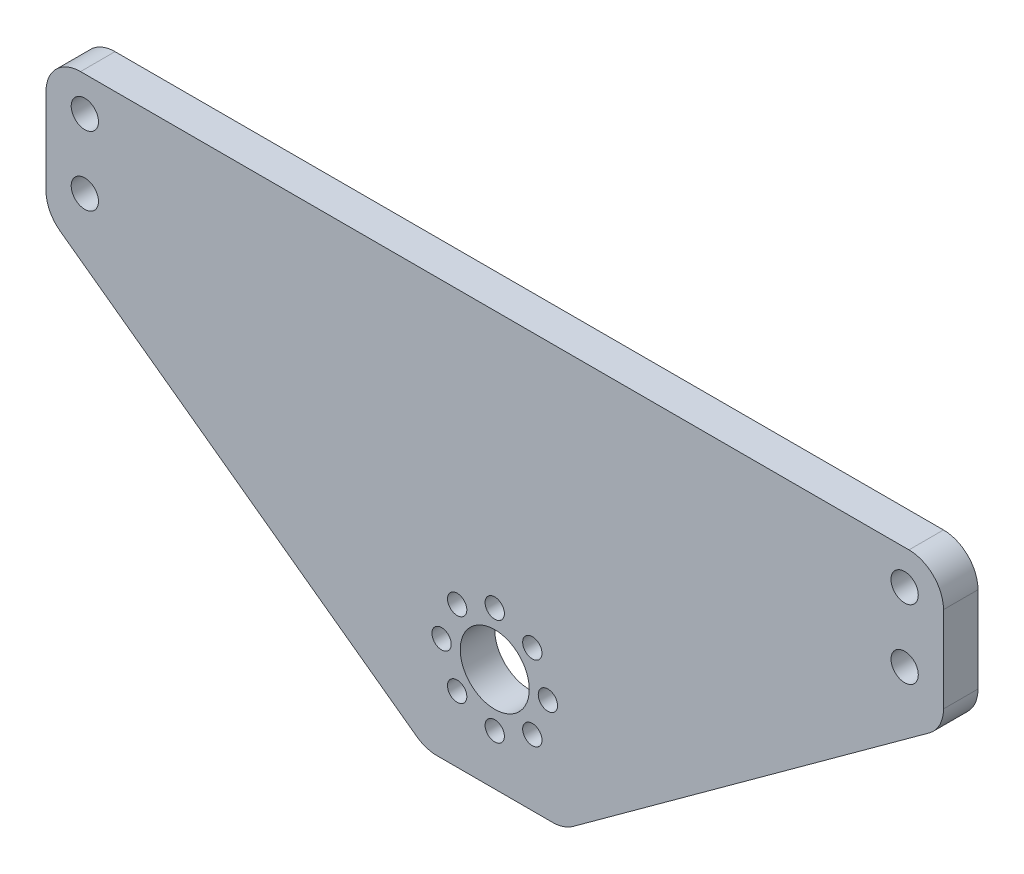
ISO-10303-21;
HEADER;
FILE_DESCRIPTION(('STEP AP214'),'2;1');
FILE_NAME('part.step','',(''),(''),'','','');
FILE_SCHEMA(('AUTOMOTIVE_DESIGN { 1 0 10303 214 1 1 1 1 }'));
ENDSEC;
DATA;
#1=APPLICATION_CONTEXT('core data for automotive mechanical design processes');
#2=APPLICATION_PROTOCOL_DEFINITION('international standard','automotive_design',2000,#1);
#3=PRODUCT_CONTEXT('',#1,'mechanical');
#4=PRODUCT('Part','Part','',(#3));
#5=PRODUCT_RELATED_PRODUCT_CATEGORY('part','',(#4));
#6=PRODUCT_DEFINITION_FORMATION('','',#4);
#7=PRODUCT_DEFINITION_CONTEXT('part definition',#1,'design');
#8=PRODUCT_DEFINITION('design','',#6,#7);
#9=PRODUCT_DEFINITION_SHAPE('','',#8);
#10=(LENGTH_UNIT() NAMED_UNIT(*) SI_UNIT(.MILLI.,.METRE.));
#11=(NAMED_UNIT(*) PLANE_ANGLE_UNIT() SI_UNIT($,.RADIAN.));
#12=(NAMED_UNIT(*) SI_UNIT($,.STERADIAN.) SOLID_ANGLE_UNIT());
#13=UNCERTAINTY_MEASURE_WITH_UNIT(LENGTH_MEASURE(1.E-05),#10,'distance_accuracy_value','');
#14=(GEOMETRIC_REPRESENTATION_CONTEXT(3) GLOBAL_UNCERTAINTY_ASSIGNED_CONTEXT((#13)) GLOBAL_UNIT_ASSIGNED_CONTEXT((#10,
#11,#12)) REPRESENTATION_CONTEXT('',''));
#15=CARTESIAN_POINT('',(0.,0.,0.));
#16=DIRECTION('',(0.,0.,1.));
#17=DIRECTION('',(1.,0.,0.));
#18=AXIS2_PLACEMENT_3D('',#15,#16,#17);
#19=CARTESIAN_POINT('',(0.,0.,6.35));
#20=DIRECTION('',(0.,0.,-1.));
#21=DIRECTION('',(-1.,0.,0.));
#22=AXIS2_PLACEMENT_3D('',#19,#20,#21);
#23=PLANE('',#22);
#24=CARTESIAN_POINT('',(-9.779,-19.05,6.35));
#25=DIRECTION('',(0.,0.,-1.));
#26=DIRECTION('',(0.,-1.,0.));
#27=AXIS2_PLACEMENT_3D('',#24,#25,#26);
#28=CIRCLE('',#27,1.778);
#29=CARTESIAN_POINT('',(-9.77899999999999,-20.828,6.35));
#30=VERTEX_POINT('',#29);
#31=EDGE_CURVE('E505',#30,#30,#28,.T.);
#32=ORIENTED_EDGE('',*,*,#31,.T.);
#33=EDGE_LOOP('',(#32));
#34=FACE_BOUND('',#33,.T.);
#35=CARTESIAN_POINT('',(-6.91479721322321,-25.9647972132233,6.35));
#36=DIRECTION('',(0.,0.,-1.));
#37=DIRECTION('',(0.707106781186551,-0.707106781186544,0.));
#38=AXIS2_PLACEMENT_3D('',#35,#36,#37);
#39=CIRCLE('',#38,1.778);
#40=CARTESIAN_POINT('',(-5.65756135627352,-27.222033070173,6.35));
#41=VERTEX_POINT('',#40);
#42=EDGE_CURVE('E509',#41,#41,#39,.T.);
#43=ORIENTED_EDGE('',*,*,#42,.T.);
#44=EDGE_LOOP('',(#43));
#45=FACE_BOUND('',#44,.T.);
#46=CARTESIAN_POINT('',(0.,-28.829,6.35));
#47=DIRECTION('',(0.,0.,-1.));
#48=DIRECTION('',(1.,0.,0.));
#49=AXIS2_PLACEMENT_3D('',#46,#47,#48);
#50=CIRCLE('',#49,1.778);
#51=CARTESIAN_POINT('',(1.778,-28.829,6.35));
#52=VERTEX_POINT('',#51);
#53=EDGE_CURVE('E520',#52,#52,#50,.T.);
#54=ORIENTED_EDGE('',*,*,#53,.T.);
#55=EDGE_LOOP('',(#54));
#56=FACE_BOUND('',#55,.T.);
#57=CARTESIAN_POINT('',(6.91479721322331,-25.9647972132232,6.35));
#58=DIRECTION('',(0.,0.,-1.));
#59=DIRECTION('',(0.707106781186541,0.707106781186554,0.));
#60=AXIS2_PLACEMENT_3D('',#57,#58,#59);
#61=CIRCLE('',#60,1.778);
#62=CARTESIAN_POINT('',(8.17203307017298,-24.7075613562735,6.35));
#63=VERTEX_POINT('',#62);
#64=EDGE_CURVE('E526',#63,#63,#61,.T.);
#65=ORIENTED_EDGE('',*,*,#64,.T.);
#66=EDGE_LOOP('',(#65));
#67=FACE_BOUND('',#66,.T.);
#68=CARTESIAN_POINT('',(9.779,-19.0499999999999,6.35));
#69=DIRECTION('',(0.,0.,-1.));
#70=DIRECTION('',(0.,1.,0.));
#71=AXIS2_PLACEMENT_3D('',#68,#69,#70);
#72=CIRCLE('',#71,1.778);
#73=CARTESIAN_POINT('',(9.77899999999998,-17.2719999999999,6.35));
#74=VERTEX_POINT('',#73);
#75=EDGE_CURVE('E532',#74,#74,#72,.T.);
#76=ORIENTED_EDGE('',*,*,#75,.T.);
#77=EDGE_LOOP('',(#76));
#78=FACE_BOUND('',#77,.T.);
#79=CARTESIAN_POINT('',(6.91479721322316,-12.1352027867767,6.35));
#80=DIRECTION('',(0.,0.,-1.));
#81=DIRECTION('',(-0.707106781186556,0.707106781186539,0.));
#82=AXIS2_PLACEMENT_3D('',#79,#80,#81);
#83=CIRCLE('',#82,1.778);
#84=CARTESIAN_POINT('',(5.65756135627347,-10.877966929827,6.35));
#85=VERTEX_POINT('',#84);
#86=EDGE_CURVE('E563',#85,#85,#83,.T.);
#87=ORIENTED_EDGE('',*,*,#86,.T.);
#88=EDGE_LOOP('',(#87));
#89=FACE_BOUND('',#88,.T.);
#90=CARTESIAN_POINT('',(-6.91479721322326,-12.1352027867768,6.35));
#91=DIRECTION('',(0.,0.,-1.));
#92=DIRECTION('',(-0.707106781186546,-0.707106781186549,0.));
#93=AXIS2_PLACEMENT_3D('',#90,#91,#92);
#94=CIRCLE('',#93,1.778);
#95=CARTESIAN_POINT('',(-8.17203307017294,-13.3924386437265,6.35));
#96=VERTEX_POINT('',#95);
#97=EDGE_CURVE('E533',#96,#96,#94,.T.);
#98=ORIENTED_EDGE('',*,*,#97,.T.);
#99=EDGE_LOOP('',(#98));
#100=FACE_BOUND('',#99,.T.);
#101=CARTESIAN_POINT('',(0.,-9.271,6.35));
#102=DIRECTION('',(0.,0.,-1.));
#103=DIRECTION('',(-1.,0.,0.));
#104=AXIS2_PLACEMENT_3D('',#101,#102,#103);
#105=CIRCLE('',#104,1.778);
#106=CARTESIAN_POINT('',(-1.778,-9.271,6.35));
#107=VERTEX_POINT('',#106);
#108=EDGE_CURVE('E229',#107,#107,#105,.T.);
#109=ORIENTED_EDGE('',*,*,#108,.T.);
#110=EDGE_LOOP('',(#109));
#111=FACE_BOUND('',#110,.T.);
#112=DIRECTION('',(-1.,0.,0.));
#113=VECTOR('',#112,1.);
#114=CARTESIAN_POINT('',(82.55,38.1,6.35));
#115=LINE('',#114,#113);
#116=CARTESIAN_POINT('',(76.2,38.1,6.35));
#117=VERTEX_POINT('',#116);
#118=CARTESIAN_POINT('',(-76.2,38.1,6.35));
#119=VERTEX_POINT('',#118);
#120=EDGE_CURVE('E161',#117,#119,#115,.T.);
#121=ORIENTED_EDGE('',*,*,#120,.T.);
#122=CARTESIAN_POINT('',(-76.2,31.75,6.35));
#123=DIRECTION('',(0.,0.,-1.));
#124=DIRECTION('',(-1.,0.,0.));
#125=AXIS2_PLACEMENT_3D('',#122,#123,#124);
#126=CIRCLE('',#125,6.35);
#127=CARTESIAN_POINT('',(-82.55,31.75,6.35));
#128=VERTEX_POINT('',#127);
#129=EDGE_CURVE('E187',#119,#128,#126,.F.);
#130=ORIENTED_EDGE('',*,*,#129,.T.);
#131=DIRECTION('',(0.,-1.,0.));
#132=VECTOR('',#131,1.);
#133=CARTESIAN_POINT('',(-82.55,38.1,6.35));
#134=LINE('',#133,#132);
#135=CARTESIAN_POINT('',(-82.55,15.9335761573154,6.35));
#136=VERTEX_POINT('',#135);
#137=EDGE_CURVE('E143',#128,#136,#134,.T.);
#138=ORIENTED_EDGE('',*,*,#137,.T.);
#139=CARTESIAN_POINT('',(-76.2,15.9335761573154,6.35));
#140=DIRECTION('',(0.,0.,-1.));
#141=DIRECTION('',(-1.,0.,0.));
#142=AXIS2_PLACEMENT_3D('',#139,#140,#141);
#143=CIRCLE('',#142,6.35);
#144=CARTESIAN_POINT('',(-79.9348902802365,10.7981020219902,6.35));
#145=VERTEX_POINT('',#144);
#146=EDGE_CURVE('E184',#136,#145,#143,.F.);
#147=ORIENTED_EDGE('',*,*,#146,.T.);
#148=DIRECTION('',(0.808736084303189,-0.588171697675046,0.));
#149=VECTOR('',#148,1.);
#150=CARTESIAN_POINT('',(-12.7,-38.1,6.35));
#151=LINE('',#150,#149);
#152=CARTESIAN_POINT('',(-14.3699730639278,-36.8854741353253,6.35));
#153=VERTEX_POINT('',#152);
#154=EDGE_CURVE('E245',#145,#153,#151,.T.);
#155=ORIENTED_EDGE('',*,*,#154,.T.);
#156=CARTESIAN_POINT('',(-10.6350827836912,-31.75,6.35));
#157=DIRECTION('',(0.,0.,-1.));
#158=DIRECTION('',(-1.,0.,0.));
#159=AXIS2_PLACEMENT_3D('',#156,#157,#158);
#160=CIRCLE('',#159,6.35);
#161=CARTESIAN_POINT('',(-10.6350827836912,-38.1,6.35));
#162=VERTEX_POINT('',#161);
#163=EDGE_CURVE('E182',#153,#162,#160,.F.);
#164=ORIENTED_EDGE('',*,*,#163,.T.);
#165=DIRECTION('',(1.,0.,0.));
#166=VECTOR('',#165,1.);
#167=CARTESIAN_POINT('',(82.55,-38.1,6.35));
#168=LINE('',#167,#166);
#169=CARTESIAN_POINT('',(10.6350827836913,-38.1,6.35));
#170=VERTEX_POINT('',#169);
#171=EDGE_CURVE('E207',#162,#170,#168,.T.);
#172=ORIENTED_EDGE('',*,*,#171,.T.);
#173=CARTESIAN_POINT('',(10.6350827836913,-31.75,6.35));
#174=DIRECTION('',(0.,0.,-1.));
#175=DIRECTION('',(-1.,0.,0.));
#176=AXIS2_PLACEMENT_3D('',#173,#174,#175);
#177=CIRCLE('',#176,6.35);
#178=CARTESIAN_POINT('',(14.3699730639278,-36.8854741353253,6.35));
#179=VERTEX_POINT('',#178);
#180=EDGE_CURVE('E180',#170,#179,#177,.F.);
#181=ORIENTED_EDGE('',*,*,#180,.T.);
#182=DIRECTION('',(0.808736084303188,0.588171697675046,0.));
#183=VECTOR('',#182,1.);
#184=CARTESIAN_POINT('',(82.55,12.7,6.35));
#185=LINE('',#184,#183);
#186=CARTESIAN_POINT('',(79.9348902802366,10.7981020219902,6.35));
#187=VERTEX_POINT('',#186);
#188=EDGE_CURVE('E227',#179,#187,#185,.T.);
#189=ORIENTED_EDGE('',*,*,#188,.T.);
#190=CARTESIAN_POINT('',(76.2,15.9335761573155,6.35));
#191=DIRECTION('',(0.,0.,-1.));
#192=DIRECTION('',(-1.,0.,0.));
#193=AXIS2_PLACEMENT_3D('',#190,#191,#192);
#194=CIRCLE('',#193,6.35);
#195=CARTESIAN_POINT('',(82.55,15.9335761573155,6.35));
#196=VERTEX_POINT('',#195);
#197=EDGE_CURVE('E54',#187,#196,#194,.F.);
#198=ORIENTED_EDGE('',*,*,#197,.T.);
#199=DIRECTION('',(0.,1.,0.));
#200=VECTOR('',#199,1.);
#201=CARTESIAN_POINT('',(82.55,38.1,6.35));
#202=LINE('',#201,#200);
#203=CARTESIAN_POINT('',(82.55,31.75,6.35));
#204=VERTEX_POINT('',#203);
#205=EDGE_CURVE('E217',#196,#204,#202,.T.);
#206=ORIENTED_EDGE('',*,*,#205,.T.);
#207=CARTESIAN_POINT('',(76.2,31.75,6.35));
#208=DIRECTION('',(0.,0.,-1.));
#209=DIRECTION('',(-1.,0.,0.));
#210=AXIS2_PLACEMENT_3D('',#207,#208,#209);
#211=CIRCLE('',#210,6.35);
#212=EDGE_CURVE('E178',#204,#117,#211,.F.);
#213=ORIENTED_EDGE('',*,*,#212,.T.);
#214=EDGE_LOOP('',(#121,#130,#138,#147,#155,#164,#172,#181,#189,#198,#206,#213));
#215=FACE_BOUND('',#214,.T.);
#216=CARTESIAN_POINT('',(0.,-19.05,6.35));
#217=DIRECTION('',(0.,0.,1.));
#218=DIRECTION('',(1.,0.,0.));
#219=AXIS2_PLACEMENT_3D('',#216,#217,#218);
#220=CIRCLE('',#219,6.35);
#221=CARTESIAN_POINT('',(6.35,-19.05,6.35));
#222=VERTEX_POINT('',#221);
#223=EDGE_CURVE('E152',#222,#222,#220,.T.);
#224=ORIENTED_EDGE('',*,*,#223,.F.);
#225=EDGE_LOOP('',(#224));
#226=FACE_BOUND('',#225,.T.);
#227=CARTESIAN_POINT('',(-75.40625,31.75,6.35));
#228=DIRECTION('',(0.,0.,1.));
#229=DIRECTION('',(1.,0.,0.));
#230=AXIS2_PLACEMENT_3D('',#227,#228,#229);
#231=CIRCLE('',#230,2.50825000000001);
#232=CARTESIAN_POINT('',(-72.898,31.75,6.35));
#233=VERTEX_POINT('',#232);
#234=EDGE_CURVE('E258',#233,#233,#231,.T.);
#235=ORIENTED_EDGE('',*,*,#234,.F.);
#236=EDGE_LOOP('',(#235));
#237=FACE_BOUND('',#236,.T.);
#238=CARTESIAN_POINT('',(75.40625,31.75,6.35));
#239=DIRECTION('',(0.,0.,1.));
#240=DIRECTION('',(1.,0.,0.));
#241=AXIS2_PLACEMENT_3D('',#238,#239,#240);
#242=CIRCLE('',#241,2.50825000000001);
#243=CARTESIAN_POINT('',(77.9145,31.75,6.35));
#244=VERTEX_POINT('',#243);
#245=EDGE_CURVE('E252',#244,#244,#242,.T.);
#246=ORIENTED_EDGE('',*,*,#245,.F.);
#247=EDGE_LOOP('',(#246));
#248=FACE_BOUND('',#247,.T.);
#249=CARTESIAN_POINT('',(75.40625,19.05,6.35));
#250=DIRECTION('',(0.,0.,1.));
#251=DIRECTION('',(1.,0.,0.));
#252=AXIS2_PLACEMENT_3D('',#249,#250,#251);
#253=CIRCLE('',#252,2.50825000000001);
#254=CARTESIAN_POINT('',(77.9145,19.05,6.35));
#255=VERTEX_POINT('',#254);
#256=EDGE_CURVE('E246',#255,#255,#253,.T.);
#257=ORIENTED_EDGE('',*,*,#256,.F.);
#258=EDGE_LOOP('',(#257));
#259=FACE_BOUND('',#258,.T.);
#260=CARTESIAN_POINT('',(-75.40625,19.05,6.35));
#261=DIRECTION('',(0.,0.,1.));
#262=DIRECTION('',(1.,0.,0.));
#263=AXIS2_PLACEMENT_3D('',#260,#261,#262);
#264=CIRCLE('',#263,2.50825000000001);
#265=CARTESIAN_POINT('',(-72.898,19.05,6.35));
#266=VERTEX_POINT('',#265);
#267=EDGE_CURVE('E238',#266,#266,#264,.T.);
#268=ORIENTED_EDGE('',*,*,#267,.F.);
#269=EDGE_LOOP('',(#268));
#270=FACE_BOUND('',#269,.T.);
#271=ADVANCED_FACE('F32',(#34,#45,#56,#67,#78,#89,#100,#111,#215,#226,#237,#248,#259,#270),#23,.F.);
#272=CARTESIAN_POINT('',(0.,0.,0.));
#273=DIRECTION('',(0.,0.,-1.));
#274=DIRECTION('',(-1.,0.,0.));
#275=AXIS2_PLACEMENT_3D('',#272,#273,#274);
#276=PLANE('',#275);
#277=CARTESIAN_POINT('',(-9.779,-19.05,0.));
#278=DIRECTION('',(0.,0.,-1.));
#279=DIRECTION('',(0.,-1.,0.));
#280=AXIS2_PLACEMENT_3D('',#277,#278,#279);
#281=CIRCLE('',#280,1.778);
#282=CARTESIAN_POINT('',(-9.77899999999999,-20.828,0.));
#283=VERTEX_POINT('',#282);
#284=EDGE_CURVE('E508',#283,#283,#281,.T.);
#285=ORIENTED_EDGE('',*,*,#284,.F.);
#286=EDGE_LOOP('',(#285));
#287=FACE_BOUND('',#286,.T.);
#288=CARTESIAN_POINT('',(-6.91479721322321,-25.9647972132233,0.));
#289=DIRECTION('',(0.,0.,-1.));
#290=DIRECTION('',(0.707106781186551,-0.707106781186544,0.));
#291=AXIS2_PLACEMENT_3D('',#288,#289,#290);
#292=CIRCLE('',#291,1.778);
#293=CARTESIAN_POINT('',(-5.65756135627352,-27.222033070173,0.));
#294=VERTEX_POINT('',#293);
#295=EDGE_CURVE('E514',#294,#294,#292,.T.);
#296=ORIENTED_EDGE('',*,*,#295,.F.);
#297=EDGE_LOOP('',(#296));
#298=FACE_BOUND('',#297,.T.);
#299=CARTESIAN_POINT('',(0.,-28.829,0.));
#300=DIRECTION('',(0.,0.,-1.));
#301=DIRECTION('',(1.,0.,0.));
#302=AXIS2_PLACEMENT_3D('',#299,#300,#301);
#303=CIRCLE('',#302,1.778);
#304=CARTESIAN_POINT('',(1.778,-28.829,0.));
#305=VERTEX_POINT('',#304);
#306=EDGE_CURVE('E523',#305,#305,#303,.T.);
#307=ORIENTED_EDGE('',*,*,#306,.F.);
#308=EDGE_LOOP('',(#307));
#309=FACE_BOUND('',#308,.T.);
#310=CARTESIAN_POINT('',(6.91479721322331,-25.9647972132232,0.));
#311=DIRECTION('',(0.,0.,-1.));
#312=DIRECTION('',(0.707106781186541,0.707106781186554,0.));
#313=AXIS2_PLACEMENT_3D('',#310,#311,#312);
#314=CIRCLE('',#313,1.778);
#315=CARTESIAN_POINT('',(8.17203307017298,-24.7075613562735,0.));
#316=VERTEX_POINT('',#315);
#317=EDGE_CURVE('E529',#316,#316,#314,.T.);
#318=ORIENTED_EDGE('',*,*,#317,.F.);
#319=EDGE_LOOP('',(#318));
#320=FACE_BOUND('',#319,.T.);
#321=CARTESIAN_POINT('',(9.779,-19.0499999999999,0.));
#322=DIRECTION('',(0.,0.,-1.));
#323=DIRECTION('',(0.,1.,0.));
#324=AXIS2_PLACEMENT_3D('',#321,#322,#323);
#325=CIRCLE('',#324,1.778);
#326=CARTESIAN_POINT('',(9.77899999999998,-17.2719999999999,0.));
#327=VERTEX_POINT('',#326);
#328=EDGE_CURVE('E558',#327,#327,#325,.T.);
#329=ORIENTED_EDGE('',*,*,#328,.F.);
#330=EDGE_LOOP('',(#329));
#331=FACE_BOUND('',#330,.T.);
#332=CARTESIAN_POINT('',(6.91479721322316,-12.1352027867767,0.));
#333=DIRECTION('',(0.,0.,-1.));
#334=DIRECTION('',(-0.707106781186556,0.707106781186539,0.));
#335=AXIS2_PLACEMENT_3D('',#332,#333,#334);
#336=CIRCLE('',#335,1.778);
#337=CARTESIAN_POINT('',(5.65756135627347,-10.877966929827,0.));
#338=VERTEX_POINT('',#337);
#339=EDGE_CURVE('E567',#338,#338,#336,.T.);
#340=ORIENTED_EDGE('',*,*,#339,.F.);
#341=EDGE_LOOP('',(#340));
#342=FACE_BOUND('',#341,.T.);
#343=CARTESIAN_POINT('',(-6.91479721322326,-12.1352027867768,0.));
#344=DIRECTION('',(0.,0.,-1.));
#345=DIRECTION('',(-0.707106781186546,-0.707106781186549,0.));
#346=AXIS2_PLACEMENT_3D('',#343,#344,#345);
#347=CIRCLE('',#346,1.778);
#348=CARTESIAN_POINT('',(-8.17203307017294,-13.3924386437265,0.));
#349=VERTEX_POINT('',#348);
#350=EDGE_CURVE('E511',#349,#349,#347,.T.);
#351=ORIENTED_EDGE('',*,*,#350,.F.);
#352=EDGE_LOOP('',(#351));
#353=FACE_BOUND('',#352,.T.);
#354=CARTESIAN_POINT('',(0.,-9.271,0.));
#355=DIRECTION('',(0.,0.,-1.));
#356=DIRECTION('',(-1.,0.,0.));
#357=AXIS2_PLACEMENT_3D('',#354,#355,#356);
#358=CIRCLE('',#357,1.778);
#359=CARTESIAN_POINT('',(-1.778,-9.271,0.));
#360=VERTEX_POINT('',#359);
#361=EDGE_CURVE('E234',#360,#360,#358,.T.);
#362=ORIENTED_EDGE('',*,*,#361,.F.);
#363=EDGE_LOOP('',(#362));
#364=FACE_BOUND('',#363,.T.);
#365=DIRECTION('',(0.,-1.,0.));
#366=VECTOR('',#365,1.);
#367=CARTESIAN_POINT('',(-82.55,38.1,0.));
#368=LINE('',#367,#366);
#369=CARTESIAN_POINT('',(-82.55,31.75,0.));
#370=VERTEX_POINT('',#369);
#371=CARTESIAN_POINT('',(-82.55,15.9335761573154,0.));
#372=VERTEX_POINT('',#371);
#373=EDGE_CURVE('E140',#370,#372,#368,.T.);
#374=ORIENTED_EDGE('',*,*,#373,.F.);
#375=CARTESIAN_POINT('',(-76.2,31.75,0.));
#376=DIRECTION('',(0.,0.,-1.));
#377=DIRECTION('',(-1.,0.,0.));
#378=AXIS2_PLACEMENT_3D('',#375,#376,#377);
#379=CIRCLE('',#378,6.35);
#380=CARTESIAN_POINT('',(-76.2,38.1,0.));
#381=VERTEX_POINT('',#380);
#382=EDGE_CURVE('E123',#370,#381,#379,.T.);
#383=ORIENTED_EDGE('',*,*,#382,.T.);
#384=DIRECTION('',(-1.,0.,0.));
#385=VECTOR('',#384,1.);
#386=CARTESIAN_POINT('',(82.55,38.1,0.));
#387=LINE('',#386,#385);
#388=CARTESIAN_POINT('',(76.2,38.1,0.));
#389=VERTEX_POINT('',#388);
#390=EDGE_CURVE('E165',#389,#381,#387,.T.);
#391=ORIENTED_EDGE('',*,*,#390,.F.);
#392=CARTESIAN_POINT('',(76.2,31.75,0.));
#393=DIRECTION('',(0.,0.,-1.));
#394=DIRECTION('',(-1.,0.,0.));
#395=AXIS2_PLACEMENT_3D('',#392,#393,#394);
#396=CIRCLE('',#395,6.35);
#397=CARTESIAN_POINT('',(82.55,31.75,0.));
#398=VERTEX_POINT('',#397);
#399=EDGE_CURVE('E144',#389,#398,#396,.T.);
#400=ORIENTED_EDGE('',*,*,#399,.T.);
#401=DIRECTION('',(0.,1.,0.));
#402=VECTOR('',#401,1.);
#403=CARTESIAN_POINT('',(82.55,38.1,0.));
#404=LINE('',#403,#402);
#405=CARTESIAN_POINT('',(82.55,15.9335761573155,0.));
#406=VERTEX_POINT('',#405);
#407=EDGE_CURVE('E155',#406,#398,#404,.T.);
#408=ORIENTED_EDGE('',*,*,#407,.F.);
#409=CARTESIAN_POINT('',(76.2,15.9335761573155,0.));
#410=DIRECTION('',(0.,0.,-1.));
#411=DIRECTION('',(-1.,0.,0.));
#412=AXIS2_PLACEMENT_3D('',#409,#410,#411);
#413=CIRCLE('',#412,6.35);
#414=CARTESIAN_POINT('',(79.9348902802366,10.7981020219902,0.));
#415=VERTEX_POINT('',#414);
#416=EDGE_CURVE('E134',#406,#415,#413,.T.);
#417=ORIENTED_EDGE('',*,*,#416,.T.);
#418=DIRECTION('',(0.808736084303188,0.588171697675046,0.));
#419=VECTOR('',#418,1.);
#420=CARTESIAN_POINT('',(82.55,12.7,0.));
#421=LINE('',#420,#419);
#422=CARTESIAN_POINT('',(14.3699730639278,-36.8854741353253,0.));
#423=VERTEX_POINT('',#422);
#424=EDGE_CURVE('E225',#423,#415,#421,.T.);
#425=ORIENTED_EDGE('',*,*,#424,.F.);
#426=CARTESIAN_POINT('',(10.6350827836913,-31.75,0.));
#427=DIRECTION('',(0.,0.,-1.));
#428=DIRECTION('',(-1.,0.,0.));
#429=AXIS2_PLACEMENT_3D('',#426,#427,#428);
#430=CIRCLE('',#429,6.35);
#431=CARTESIAN_POINT('',(10.6350827836913,-38.1,0.));
#432=VERTEX_POINT('',#431);
#433=EDGE_CURVE('E169',#423,#432,#430,.T.);
#434=ORIENTED_EDGE('',*,*,#433,.T.);
#435=DIRECTION('',(1.,0.,0.));
#436=VECTOR('',#435,1.);
#437=CARTESIAN_POINT('',(82.55,-38.1,0.));
#438=LINE('',#437,#436);
#439=CARTESIAN_POINT('',(-10.6350827836912,-38.1,0.));
#440=VERTEX_POINT('',#439);
#441=EDGE_CURVE('E151',#440,#432,#438,.T.);
#442=ORIENTED_EDGE('',*,*,#441,.F.);
#443=CARTESIAN_POINT('',(-10.6350827836912,-31.75,0.));
#444=DIRECTION('',(0.,0.,-1.));
#445=DIRECTION('',(-1.,0.,0.));
#446=AXIS2_PLACEMENT_3D('',#443,#444,#445);
#447=CIRCLE('',#446,6.35);
#448=CARTESIAN_POINT('',(-14.3699730639278,-36.8854741353253,0.));
#449=VERTEX_POINT('',#448);
#450=EDGE_CURVE('E171',#440,#449,#447,.T.);
#451=ORIENTED_EDGE('',*,*,#450,.T.);
#452=DIRECTION('',(0.808736084303189,-0.588171697675046,0.));
#453=VECTOR('',#452,1.);
#454=CARTESIAN_POINT('',(-12.7,-38.1,0.));
#455=LINE('',#454,#453);
#456=CARTESIAN_POINT('',(-79.9348902802365,10.7981020219902,0.));
#457=VERTEX_POINT('',#456);
#458=EDGE_CURVE('E231',#457,#449,#455,.T.);
#459=ORIENTED_EDGE('',*,*,#458,.F.);
#460=CARTESIAN_POINT('',(-76.2,15.9335761573154,0.));
#461=DIRECTION('',(0.,0.,-1.));
#462=DIRECTION('',(-1.,0.,0.));
#463=AXIS2_PLACEMENT_3D('',#460,#461,#462);
#464=CIRCLE('',#463,6.35);
#465=EDGE_CURVE('E150',#457,#372,#464,.T.);
#466=ORIENTED_EDGE('',*,*,#465,.T.);
#467=EDGE_LOOP('',(#374,#383,#391,#400,#408,#417,#425,#434,#442,#451,#459,#466));
#468=FACE_BOUND('',#467,.T.);
#469=CARTESIAN_POINT('',(75.40625,19.05,0.));
#470=DIRECTION('',(0.,0.,1.));
#471=DIRECTION('',(1.,0.,0.));
#472=AXIS2_PLACEMENT_3D('',#469,#470,#471);
#473=CIRCLE('',#472,2.50825000000001);
#474=CARTESIAN_POINT('',(77.9145,19.05,0.));
#475=VERTEX_POINT('',#474);
#476=EDGE_CURVE('E241',#475,#475,#473,.T.);
#477=ORIENTED_EDGE('',*,*,#476,.T.);
#478=EDGE_LOOP('',(#477));
#479=FACE_BOUND('',#478,.T.);
#480=CARTESIAN_POINT('',(-75.40625,31.75,0.));
#481=DIRECTION('',(0.,0.,1.));
#482=DIRECTION('',(1.,0.,0.));
#483=AXIS2_PLACEMENT_3D('',#480,#481,#482);
#484=CIRCLE('',#483,2.50825000000001);
#485=CARTESIAN_POINT('',(-72.898,31.75,0.));
#486=VERTEX_POINT('',#485);
#487=EDGE_CURVE('E255',#486,#486,#484,.T.);
#488=ORIENTED_EDGE('',*,*,#487,.T.);
#489=EDGE_LOOP('',(#488));
#490=FACE_BOUND('',#489,.T.);
#491=CARTESIAN_POINT('',(0.,-19.05,0.));
#492=DIRECTION('',(0.,0.,1.));
#493=DIRECTION('',(1.,0.,0.));
#494=AXIS2_PLACEMENT_3D('',#491,#492,#493);
#495=CIRCLE('',#494,6.35);
#496=CARTESIAN_POINT('',(6.35,-19.05,0.));
#497=VERTEX_POINT('',#496);
#498=EDGE_CURVE('E158',#497,#497,#495,.T.);
#499=ORIENTED_EDGE('',*,*,#498,.T.);
#500=EDGE_LOOP('',(#499));
#501=FACE_BOUND('',#500,.T.);
#502=CARTESIAN_POINT('',(75.40625,31.75,0.));
#503=DIRECTION('',(0.,0.,1.));
#504=DIRECTION('',(1.,0.,0.));
#505=AXIS2_PLACEMENT_3D('',#502,#503,#504);
#506=CIRCLE('',#505,2.50825000000001);
#507=CARTESIAN_POINT('',(77.9145,31.75,0.));
#508=VERTEX_POINT('',#507);
#509=EDGE_CURVE('E249',#508,#508,#506,.T.);
#510=ORIENTED_EDGE('',*,*,#509,.T.);
#511=EDGE_LOOP('',(#510));
#512=FACE_BOUND('',#511,.T.);
#513=CARTESIAN_POINT('',(-75.40625,19.05,0.));
#514=DIRECTION('',(0.,0.,1.));
#515=DIRECTION('',(1.,0.,0.));
#516=AXIS2_PLACEMENT_3D('',#513,#514,#515);
#517=CIRCLE('',#516,2.50825000000001);
#518=CARTESIAN_POINT('',(-72.898,19.05,0.));
#519=VERTEX_POINT('',#518);
#520=EDGE_CURVE('E242',#519,#519,#517,.T.);
#521=ORIENTED_EDGE('',*,*,#520,.T.);
#522=EDGE_LOOP('',(#521));
#523=FACE_BOUND('',#522,.T.);
#524=ADVANCED_FACE('F147',(#287,#298,#309,#320,#331,#342,#353,#364,#468,#479,#490,#501,#512,
#523),#276,.T.);
#525=CARTESIAN_POINT('',(-82.55,38.1,6.35));
#526=DIRECTION('',(1.,0.,0.));
#527=DIRECTION('',(0.,1.,0.));
#528=AXIS2_PLACEMENT_3D('',#525,#526,#527);
#529=PLANE('',#528);
#530=ORIENTED_EDGE('',*,*,#137,.F.);
#531=DIRECTION('',(0.,0.,-1.));
#532=VECTOR('',#531,1.);
#533=CARTESIAN_POINT('',(-82.55,31.75,6.35));
#534=LINE('',#533,#532);
#535=EDGE_CURVE('E127',#128,#370,#534,.T.);
#536=ORIENTED_EDGE('',*,*,#535,.T.);
#537=ORIENTED_EDGE('',*,*,#373,.T.);
#538=DIRECTION('',(0.,0.,-1.));
#539=VECTOR('',#538,1.);
#540=CARTESIAN_POINT('',(-82.55,15.9335761573154,6.35));
#541=LINE('',#540,#539);
#542=EDGE_CURVE('E145',#372,#136,#541,.F.);
#543=ORIENTED_EDGE('',*,*,#542,.T.);
#544=EDGE_LOOP('',(#530,#536,#537,#543));
#545=FACE_BOUND('',#544,.T.);
#546=ADVANCED_FACE('F139',(#545),#529,.F.);
#547=CARTESIAN_POINT('',(82.55,-38.1,6.35));
#548=DIRECTION('',(0.,1.,0.));
#549=DIRECTION('',(-1.,0.,0.));
#550=AXIS2_PLACEMENT_3D('',#547,#548,#549);
#551=PLANE('',#550);
#552=ORIENTED_EDGE('',*,*,#171,.F.);
#553=DIRECTION('',(0.,0.,-1.));
#554=VECTOR('',#553,1.);
#555=CARTESIAN_POINT('',(-10.6350827836912,-38.1,6.35));
#556=LINE('',#555,#554);
#557=EDGE_CURVE('E11',#162,#440,#556,.T.);
#558=ORIENTED_EDGE('',*,*,#557,.T.);
#559=ORIENTED_EDGE('',*,*,#441,.T.);
#560=DIRECTION('',(0.,0.,-1.));
#561=VECTOR('',#560,1.);
#562=CARTESIAN_POINT('',(10.6350827836913,-38.1,6.35));
#563=LINE('',#562,#561);
#564=EDGE_CURVE('E40',#432,#170,#563,.F.);
#565=ORIENTED_EDGE('',*,*,#564,.T.);
#566=EDGE_LOOP('',(#552,#558,#559,#565));
#567=FACE_BOUND('',#566,.T.);
#568=ADVANCED_FACE('F206',(#567),#551,.F.);
#569=CARTESIAN_POINT('',(82.55,38.1,6.35));
#570=DIRECTION('',(-1.,0.,0.));
#571=DIRECTION('',(0.,0.,1.));
#572=AXIS2_PLACEMENT_3D('',#569,#570,#571);
#573=PLANE('',#572);
#574=ORIENTED_EDGE('',*,*,#205,.F.);
#575=DIRECTION('',(0.,0.,-1.));
#576=VECTOR('',#575,1.);
#577=CARTESIAN_POINT('',(82.55,15.9335761573155,6.35));
#578=LINE('',#577,#576);
#579=EDGE_CURVE('E190',#196,#406,#578,.T.);
#580=ORIENTED_EDGE('',*,*,#579,.T.);
#581=ORIENTED_EDGE('',*,*,#407,.T.);
#582=DIRECTION('',(0.,0.,-1.));
#583=VECTOR('',#582,1.);
#584=CARTESIAN_POINT('',(82.55,31.75,6.35));
#585=LINE('',#584,#583);
#586=EDGE_CURVE('E47',#398,#204,#585,.F.);
#587=ORIENTED_EDGE('',*,*,#586,.T.);
#588=EDGE_LOOP('',(#574,#580,#581,#587));
#589=FACE_BOUND('',#588,.T.);
#590=ADVANCED_FACE('F271',(#589),#573,.F.);
#591=CARTESIAN_POINT('',(82.55,38.1,6.35));
#592=DIRECTION('',(0.,-1.,0.));
#593=DIRECTION('',(1.,0.,0.));
#594=AXIS2_PLACEMENT_3D('',#591,#592,#593);
#595=PLANE('',#594);
#596=ORIENTED_EDGE('',*,*,#390,.T.);
#597=DIRECTION('',(0.,0.,-1.));
#598=VECTOR('',#597,1.);
#599=CARTESIAN_POINT('',(-76.2,38.1,6.35));
#600=LINE('',#599,#598);
#601=EDGE_CURVE('E128',#381,#119,#600,.F.);
#602=ORIENTED_EDGE('',*,*,#601,.T.);
#603=ORIENTED_EDGE('',*,*,#120,.F.);
#604=DIRECTION('',(0.,0.,-1.));
#605=VECTOR('',#604,1.);
#606=CARTESIAN_POINT('',(76.2,38.1,6.35));
#607=LINE('',#606,#605);
#608=EDGE_CURVE('E133',#117,#389,#607,.T.);
#609=ORIENTED_EDGE('',*,*,#608,.T.);
#610=EDGE_LOOP('',(#596,#602,#603,#609));
#611=FACE_BOUND('',#610,.T.);
#612=ADVANCED_FACE('F269',(#611),#595,.F.);
#613=CARTESIAN_POINT('',(0.,-19.05,6.35));
#614=DIRECTION('',(0.,0.,-1.));
#615=DIRECTION('',(-1.,0.,0.));
#616=AXIS2_PLACEMENT_3D('',#613,#614,#615);
#617=CYLINDRICAL_SURFACE('',#616,6.35);
#618=ORIENTED_EDGE('',*,*,#223,.T.);
#619=EDGE_LOOP('',(#618));
#620=FACE_BOUND('',#619,.T.);
#621=ORIENTED_EDGE('',*,*,#498,.F.);
#622=EDGE_LOOP('',(#621));
#623=FACE_BOUND('',#622,.T.);
#624=ADVANCED_FACE('F298',(#620,#623),#617,.F.);
#625=CARTESIAN_POINT('',(-75.40625,31.75,6.35));
#626=DIRECTION('',(0.,0.,-1.));
#627=DIRECTION('',(-1.,0.,0.));
#628=AXIS2_PLACEMENT_3D('',#625,#626,#627);
#629=CYLINDRICAL_SURFACE('',#628,2.50825000000001);
#630=ORIENTED_EDGE('',*,*,#234,.T.);
#631=EDGE_LOOP('',(#630));
#632=FACE_BOUND('',#631,.T.);
#633=ORIENTED_EDGE('',*,*,#487,.F.);
#634=EDGE_LOOP('',(#633));
#635=FACE_BOUND('',#634,.T.);
#636=ADVANCED_FACE('F332',(#632,#635),#629,.F.);
#637=CARTESIAN_POINT('',(75.40625,31.75,6.35));
#638=DIRECTION('',(0.,0.,-1.));
#639=DIRECTION('',(-1.,0.,0.));
#640=AXIS2_PLACEMENT_3D('',#637,#638,#639);
#641=CYLINDRICAL_SURFACE('',#640,2.50825000000001);
#642=ORIENTED_EDGE('',*,*,#245,.T.);
#643=EDGE_LOOP('',(#642));
#644=FACE_BOUND('',#643,.T.);
#645=ORIENTED_EDGE('',*,*,#509,.F.);
#646=EDGE_LOOP('',(#645));
#647=FACE_BOUND('',#646,.T.);
#648=ADVANCED_FACE('F339',(#644,#647),#641,.F.);
#649=CARTESIAN_POINT('',(75.40625,19.05,6.35));
#650=DIRECTION('',(0.,0.,-1.));
#651=DIRECTION('',(-1.,0.,0.));
#652=AXIS2_PLACEMENT_3D('',#649,#650,#651);
#653=CYLINDRICAL_SURFACE('',#652,2.50825000000001);
#654=ORIENTED_EDGE('',*,*,#256,.T.);
#655=EDGE_LOOP('',(#654));
#656=FACE_BOUND('',#655,.T.);
#657=ORIENTED_EDGE('',*,*,#476,.F.);
#658=EDGE_LOOP('',(#657));
#659=FACE_BOUND('',#658,.T.);
#660=ADVANCED_FACE('F346',(#656,#659),#653,.F.);
#661=CARTESIAN_POINT('',(-75.40625,19.05,6.35));
#662=DIRECTION('',(0.,0.,-1.));
#663=DIRECTION('',(-1.,0.,0.));
#664=AXIS2_PLACEMENT_3D('',#661,#662,#663);
#665=CYLINDRICAL_SURFACE('',#664,2.50825000000001);
#666=ORIENTED_EDGE('',*,*,#267,.T.);
#667=EDGE_LOOP('',(#666));
#668=FACE_BOUND('',#667,.T.);
#669=ORIENTED_EDGE('',*,*,#520,.F.);
#670=EDGE_LOOP('',(#669));
#671=FACE_BOUND('',#670,.T.);
#672=ADVANCED_FACE('F354',(#668,#671),#665,.F.);
#673=CARTESIAN_POINT('',(82.55,12.7,6.35));
#674=DIRECTION('',(-0.588171697675046,0.808736084303188,0.));
#675=DIRECTION('',(-0.808736084303189,-0.588171697675047,0.));
#676=AXIS2_PLACEMENT_3D('',#673,#674,#675);
#677=PLANE('',#676);
#678=ORIENTED_EDGE('',*,*,#424,.T.);
#679=DIRECTION('',(0.,0.,-1.));
#680=VECTOR('',#679,1.);
#681=CARTESIAN_POINT('',(79.9348902802366,10.7981020219902,6.35));
#682=LINE('',#681,#680);
#683=EDGE_CURVE('E196',#415,#187,#682,.F.);
#684=ORIENTED_EDGE('',*,*,#683,.T.);
#685=ORIENTED_EDGE('',*,*,#188,.F.);
#686=DIRECTION('',(0.,0.,-1.));
#687=VECTOR('',#686,1.);
#688=CARTESIAN_POINT('',(14.3699730639278,-36.8854741353253,6.35));
#689=LINE('',#688,#687);
#690=EDGE_CURVE('E193',#179,#423,#689,.T.);
#691=ORIENTED_EDGE('',*,*,#690,.T.);
#692=EDGE_LOOP('',(#678,#684,#685,#691));
#693=FACE_BOUND('',#692,.T.);
#694=ADVANCED_FACE('F224',(#693),#677,.F.);
#695=CARTESIAN_POINT('',(-12.7,-38.1,6.35));
#696=DIRECTION('',(0.588171697675046,0.808736084303188,0.));
#697=DIRECTION('',(-0.808736084303189,0.588171697675046,0.));
#698=AXIS2_PLACEMENT_3D('',#695,#696,#697);
#699=PLANE('',#698);
#700=ORIENTED_EDGE('',*,*,#154,.F.);
#701=DIRECTION('',(0.,0.,-1.));
#702=VECTOR('',#701,1.);
#703=CARTESIAN_POINT('',(-79.9348902802365,10.7981020219902,6.35));
#704=LINE('',#703,#702);
#705=EDGE_CURVE('E200',#145,#457,#704,.T.);
#706=ORIENTED_EDGE('',*,*,#705,.T.);
#707=ORIENTED_EDGE('',*,*,#458,.T.);
#708=DIRECTION('',(0.,0.,-1.));
#709=VECTOR('',#708,1.);
#710=CARTESIAN_POINT('',(-14.3699730639278,-36.8854741353253,6.35));
#711=LINE('',#710,#709);
#712=EDGE_CURVE('E198',#449,#153,#711,.F.);
#713=ORIENTED_EDGE('',*,*,#712,.T.);
#714=EDGE_LOOP('',(#700,#706,#707,#713));
#715=FACE_BOUND('',#714,.T.);
#716=ADVANCED_FACE('F285',(#715),#699,.F.);
#717=CARTESIAN_POINT('',(-76.2,31.75,6.35));
#718=DIRECTION('',(0.,0.,-1.));
#719=DIRECTION('',(-1.,0.,0.));
#720=AXIS2_PLACEMENT_3D('',#717,#718,#719);
#721=CYLINDRICAL_SURFACE('',#720,6.35);
#722=ORIENTED_EDGE('',*,*,#129,.F.);
#723=ORIENTED_EDGE('',*,*,#601,.F.);
#724=ORIENTED_EDGE('',*,*,#382,.F.);
#725=ORIENTED_EDGE('',*,*,#535,.F.);
#726=EDGE_LOOP('',(#722,#723,#724,#725));
#727=FACE_BOUND('',#726,.T.);
#728=ADVANCED_FACE('F126',(#727),#721,.T.);
#729=CARTESIAN_POINT('',(76.2,15.9335761573155,6.35));
#730=DIRECTION('',(0.,0.,-1.));
#731=DIRECTION('',(-1.,0.,0.));
#732=AXIS2_PLACEMENT_3D('',#729,#730,#731);
#733=CYLINDRICAL_SURFACE('',#732,6.35);
#734=ORIENTED_EDGE('',*,*,#197,.F.);
#735=ORIENTED_EDGE('',*,*,#683,.F.);
#736=ORIENTED_EDGE('',*,*,#416,.F.);
#737=ORIENTED_EDGE('',*,*,#579,.F.);
#738=EDGE_LOOP('',(#734,#735,#736,#737));
#739=FACE_BOUND('',#738,.T.);
#740=ADVANCED_FACE('F274',(#739),#733,.T.);
#741=CARTESIAN_POINT('',(-76.2,15.9335761573154,6.35));
#742=DIRECTION('',(0.,0.,-1.));
#743=DIRECTION('',(-1.,0.,0.));
#744=AXIS2_PLACEMENT_3D('',#741,#742,#743);
#745=CYLINDRICAL_SURFACE('',#744,6.35);
#746=ORIENTED_EDGE('',*,*,#146,.F.);
#747=ORIENTED_EDGE('',*,*,#542,.F.);
#748=ORIENTED_EDGE('',*,*,#465,.F.);
#749=ORIENTED_EDGE('',*,*,#705,.F.);
#750=EDGE_LOOP('',(#746,#747,#748,#749));
#751=FACE_BOUND('',#750,.T.);
#752=ADVANCED_FACE('F276',(#751),#745,.T.);
#753=CARTESIAN_POINT('',(-10.6350827836912,-31.75,6.35));
#754=DIRECTION('',(0.,0.,-1.));
#755=DIRECTION('',(-1.,0.,0.));
#756=AXIS2_PLACEMENT_3D('',#753,#754,#755);
#757=CYLINDRICAL_SURFACE('',#756,6.35);
#758=ORIENTED_EDGE('',*,*,#163,.F.);
#759=ORIENTED_EDGE('',*,*,#712,.F.);
#760=ORIENTED_EDGE('',*,*,#450,.F.);
#761=ORIENTED_EDGE('',*,*,#557,.F.);
#762=EDGE_LOOP('',(#758,#759,#760,#761));
#763=FACE_BOUND('',#762,.T.);
#764=ADVANCED_FACE('F282',(#763),#757,.T.);
#765=CARTESIAN_POINT('',(10.6350827836913,-31.75,6.35));
#766=DIRECTION('',(0.,0.,-1.));
#767=DIRECTION('',(-1.,0.,0.));
#768=AXIS2_PLACEMENT_3D('',#765,#766,#767);
#769=CYLINDRICAL_SURFACE('',#768,6.35);
#770=ORIENTED_EDGE('',*,*,#180,.F.);
#771=ORIENTED_EDGE('',*,*,#564,.F.);
#772=ORIENTED_EDGE('',*,*,#433,.F.);
#773=ORIENTED_EDGE('',*,*,#690,.F.);
#774=EDGE_LOOP('',(#770,#771,#772,#773));
#775=FACE_BOUND('',#774,.T.);
#776=ADVANCED_FACE('F220',(#775),#769,.T.);
#777=CARTESIAN_POINT('',(76.2,31.75,6.35));
#778=DIRECTION('',(0.,0.,-1.));
#779=DIRECTION('',(-1.,0.,0.));
#780=AXIS2_PLACEMENT_3D('',#777,#778,#779);
#781=CYLINDRICAL_SURFACE('',#780,6.35);
#782=ORIENTED_EDGE('',*,*,#212,.F.);
#783=ORIENTED_EDGE('',*,*,#586,.F.);
#784=ORIENTED_EDGE('',*,*,#399,.F.);
#785=ORIENTED_EDGE('',*,*,#608,.F.);
#786=EDGE_LOOP('',(#782,#783,#784,#785));
#787=FACE_BOUND('',#786,.T.);
#788=ADVANCED_FACE('F34',(#787),#781,.T.);
#789=CARTESIAN_POINT('',(0.,-9.271,6.35));
#790=DIRECTION('',(0.,0.,-1.));
#791=DIRECTION('',(-1.,0.,0.));
#792=AXIS2_PLACEMENT_3D('',#789,#790,#791);
#793=CYLINDRICAL_SURFACE('',#792,1.778);
#794=ORIENTED_EDGE('',*,*,#108,.F.);
#795=EDGE_LOOP('',(#794));
#796=FACE_BOUND('',#795,.T.);
#797=ORIENTED_EDGE('',*,*,#361,.T.);
#798=EDGE_LOOP('',(#797));
#799=FACE_BOUND('',#798,.T.);
#800=ADVANCED_FACE('F413',(#796,#799),#793,.F.);
#801=CARTESIAN_POINT('',(-6.91479721322326,-12.1352027867768,6.35));
#802=DIRECTION('',(0.,0.,-1.));
#803=DIRECTION('',(-1.,0.,0.));
#804=AXIS2_PLACEMENT_3D('',#801,#802,#803);
#805=CYLINDRICAL_SURFACE('',#804,1.778);
#806=ORIENTED_EDGE('',*,*,#97,.F.);
#807=EDGE_LOOP('',(#806));
#808=FACE_BOUND('',#807,.T.);
#809=ORIENTED_EDGE('',*,*,#350,.T.);
#810=EDGE_LOOP('',(#809));
#811=FACE_BOUND('',#810,.T.);
#812=ADVANCED_FACE('F420',(#808,#811),#805,.F.);
#813=CARTESIAN_POINT('',(6.91479721322316,-12.1352027867767,6.35));
#814=DIRECTION('',(0.,0.,-1.));
#815=DIRECTION('',(-1.,0.,0.));
#816=AXIS2_PLACEMENT_3D('',#813,#814,#815);
#817=CYLINDRICAL_SURFACE('',#816,1.778);
#818=ORIENTED_EDGE('',*,*,#86,.F.);
#819=EDGE_LOOP('',(#818));
#820=FACE_BOUND('',#819,.T.);
#821=ORIENTED_EDGE('',*,*,#339,.T.);
#822=EDGE_LOOP('',(#821));
#823=FACE_BOUND('',#822,.T.);
#824=ADVANCED_FACE('F439',(#820,#823),#817,.F.);
#825=CARTESIAN_POINT('',(9.779,-19.0499999999999,6.35));
#826=DIRECTION('',(0.,0.,-1.));
#827=DIRECTION('',(-1.,0.,0.));
#828=AXIS2_PLACEMENT_3D('',#825,#826,#827);
#829=CYLINDRICAL_SURFACE('',#828,1.778);
#830=ORIENTED_EDGE('',*,*,#75,.F.);
#831=EDGE_LOOP('',(#830));
#832=FACE_BOUND('',#831,.T.);
#833=ORIENTED_EDGE('',*,*,#328,.T.);
#834=EDGE_LOOP('',(#833));
#835=FACE_BOUND('',#834,.T.);
#836=ADVANCED_FACE('F449',(#832,#835),#829,.F.);
#837=CARTESIAN_POINT('',(6.91479721322331,-25.9647972132232,6.35));
#838=DIRECTION('',(0.,0.,-1.));
#839=DIRECTION('',(-1.,0.,0.));
#840=AXIS2_PLACEMENT_3D('',#837,#838,#839);
#841=CYLINDRICAL_SURFACE('',#840,1.778);
#842=ORIENTED_EDGE('',*,*,#64,.F.);
#843=EDGE_LOOP('',(#842));
#844=FACE_BOUND('',#843,.T.);
#845=ORIENTED_EDGE('',*,*,#317,.T.);
#846=EDGE_LOOP('',(#845));
#847=FACE_BOUND('',#846,.T.);
#848=ADVANCED_FACE('F459',(#844,#847),#841,.F.);
#849=CARTESIAN_POINT('',(0.,-28.829,6.35));
#850=DIRECTION('',(0.,0.,-1.));
#851=DIRECTION('',(-1.,0.,0.));
#852=AXIS2_PLACEMENT_3D('',#849,#850,#851);
#853=CYLINDRICAL_SURFACE('',#852,1.778);
#854=ORIENTED_EDGE('',*,*,#53,.F.);
#855=EDGE_LOOP('',(#854));
#856=FACE_BOUND('',#855,.T.);
#857=ORIENTED_EDGE('',*,*,#306,.T.);
#858=EDGE_LOOP('',(#857));
#859=FACE_BOUND('',#858,.T.);
#860=ADVANCED_FACE('F469',(#856,#859),#853,.F.);
#861=CARTESIAN_POINT('',(-6.91479721322321,-25.9647972132233,6.35));
#862=DIRECTION('',(0.,0.,-1.));
#863=DIRECTION('',(-1.,0.,0.));
#864=AXIS2_PLACEMENT_3D('',#861,#862,#863);
#865=CYLINDRICAL_SURFACE('',#864,1.778);
#866=ORIENTED_EDGE('',*,*,#42,.F.);
#867=EDGE_LOOP('',(#866));
#868=FACE_BOUND('',#867,.T.);
#869=ORIENTED_EDGE('',*,*,#295,.T.);
#870=EDGE_LOOP('',(#869));
#871=FACE_BOUND('',#870,.T.);
#872=ADVANCED_FACE('F479',(#868,#871),#865,.F.);
#873=CARTESIAN_POINT('',(-9.779,-19.05,6.35));
#874=DIRECTION('',(0.,0.,-1.));
#875=DIRECTION('',(-1.,0.,0.));
#876=AXIS2_PLACEMENT_3D('',#873,#874,#875);
#877=CYLINDRICAL_SURFACE('',#876,1.778);
#878=ORIENTED_EDGE('',*,*,#31,.F.);
#879=EDGE_LOOP('',(#878));
#880=FACE_BOUND('',#879,.T.);
#881=ORIENTED_EDGE('',*,*,#284,.T.);
#882=EDGE_LOOP('',(#881));
#883=FACE_BOUND('',#882,.T.);
#884=ADVANCED_FACE('F489',(#880,#883),#877,.F.);
#885=CLOSED_SHELL('',(#271,#524,#546,#568,#590,#612,#624,#636,#648,#660,#672,#694,#716,#728,
#740,#752,#764,#776,#788,#800,#812,#824,#836,#848,#860,#872,#884));
#886=MANIFOLD_SOLID_BREP('B2',#885);
#887=ADVANCED_BREP_SHAPE_REPRESENTATION('',(#18,#886),#14);
#888=SHAPE_DEFINITION_REPRESENTATION(#9,#887);
ENDSEC;
END-ISO-10303-21;
